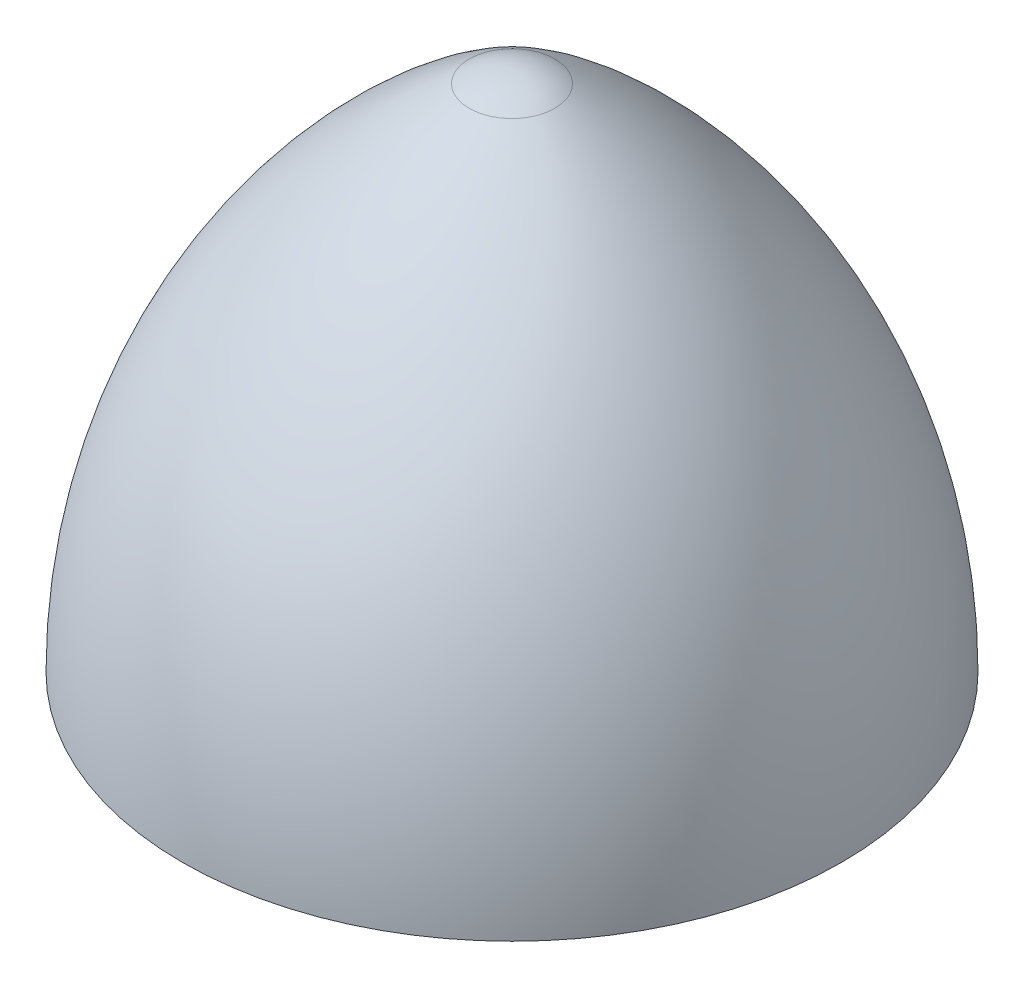
ISO-10303-21;
HEADER;
FILE_DESCRIPTION(('STEP AP214'),'2;1');
FILE_NAME('part.step','',(''),(''),'','','');
FILE_SCHEMA(('AUTOMOTIVE_DESIGN { 1 0 10303 214 1 1 1 1 }'));
ENDSEC;
DATA;
#1=APPLICATION_CONTEXT('core data for automotive mechanical design processes');
#2=APPLICATION_PROTOCOL_DEFINITION('international standard','automotive_design',2000,#1);
#3=PRODUCT_CONTEXT('',#1,'mechanical');
#4=PRODUCT('Part','Part','',(#3));
#5=PRODUCT_RELATED_PRODUCT_CATEGORY('part','',(#4));
#6=PRODUCT_DEFINITION_FORMATION('','',#4);
#7=PRODUCT_DEFINITION_CONTEXT('part definition',#1,'design');
#8=PRODUCT_DEFINITION('design','',#6,#7);
#9=PRODUCT_DEFINITION_SHAPE('','',#8);
#10=(LENGTH_UNIT() NAMED_UNIT(*) SI_UNIT(.MILLI.,.METRE.));
#11=(NAMED_UNIT(*) PLANE_ANGLE_UNIT() SI_UNIT($,.RADIAN.));
#12=(NAMED_UNIT(*) SI_UNIT($,.STERADIAN.) SOLID_ANGLE_UNIT());
#13=UNCERTAINTY_MEASURE_WITH_UNIT(LENGTH_MEASURE(1.E-05),#10,'distance_accuracy_value','');
#14=(GEOMETRIC_REPRESENTATION_CONTEXT(3) GLOBAL_UNCERTAINTY_ASSIGNED_CONTEXT((#13)) GLOBAL_UNIT_ASSIGNED_CONTEXT((#10,
#11,#12)) REPRESENTATION_CONTEXT('',''));
#15=CARTESIAN_POINT('',(0.,0.,0.));
#16=DIRECTION('',(0.,0.,1.));
#17=DIRECTION('',(1.,0.,0.));
#18=AXIS2_PLACEMENT_3D('',#15,#16,#17);
#19=CARTESIAN_POINT('',(0.,-25.4,0.));
#20=DIRECTION('',(0.,-1.,0.));
#21=DIRECTION('',(1.,0.,0.));
#22=AXIS2_PLACEMENT_3D('',#19,#20,#21);
#23=DEGENERATE_TOROIDAL_SURFACE('',#22,15.4340277777778,34.4840277777778,.F.);
#24=CARTESIAN_POINT('',(0.,4.07002967359048,0.));
#25=DIRECTION('',(0.,-1.,0.));
#26=DIRECTION('',(1.,0.,0.));
#27=AXIS2_PLACEMENT_3D('',#24,#25,#26);
#28=CIRCLE('',#27,2.47310830860532);
#29=CARTESIAN_POINT('',(2.47310830860533,4.07002967359048,0.));
#30=VERTEX_POINT('',#29);
#31=EDGE_CURVE('E11',#30,#30,#28,.T.);
#32=ORIENTED_EDGE('',*,*,#31,.T.);
#33=EDGE_LOOP('',(#32));
#34=FACE_BOUND('',#33,.T.);
#35=CARTESIAN_POINT('',(0.,-25.4,0.));
#36=DIRECTION('',(0.,-1.,0.));
#37=DIRECTION('',(1.,0.,0.));
#38=AXIS2_PLACEMENT_3D('',#35,#36,#37);
#39=CIRCLE('',#38,19.05);
#40=CARTESIAN_POINT('',(19.05,-25.4,0.));
#41=VERTEX_POINT('',#40);
#42=EDGE_CURVE('E55',#41,#41,#39,.T.);
#43=ORIENTED_EDGE('',*,*,#42,.F.);
#44=EDGE_LOOP('',(#43));
#45=FACE_BOUND('',#44,.T.);
#46=ADVANCED_FACE('F48',(#34,#45),#23,.F.);
#47=CARTESIAN_POINT('',(0.,0.,0.));
#48=DIRECTION('',(0.,-1.,0.));
#49=DIRECTION('',(1.,0.,0.));
#50=AXIS2_PLACEMENT_3D('',#47,#48,#49);
#51=SPHERICAL_SURFACE('',#50,4.76249999999997);
#52=ORIENTED_EDGE('',*,*,#31,.F.);
#53=EDGE_LOOP('',(#52));
#54=FACE_BOUND('',#53,.T.);
#55=ADVANCED_FACE('F81',(#54),#51,.T.);
#56=CARTESIAN_POINT('',(0.,-25.4,0.));
#57=DIRECTION('',(0.,-1.,0.));
#58=DIRECTION('',(1.,0.,0.));
#59=AXIS2_PLACEMENT_3D('',#56,#57,#58);
#60=PLANE('',#59);
#61=CARTESIAN_POINT('',(0.,-25.4,0.));
#62=DIRECTION('',(0.,-1.,0.));
#63=DIRECTION('',(0.,0.,-1.));
#64=AXIS2_PLACEMENT_3D('',#61,#62,#63);
#65=CIRCLE('',#64,5.75436999999999);
#66=CARTESIAN_POINT('',(0.,-25.4,-5.75436999999999));
#67=VERTEX_POINT('',#66);
#68=EDGE_CURVE('E69',#67,#67,#65,.T.);
#69=ORIENTED_EDGE('',*,*,#68,.F.);
#70=EDGE_LOOP('',(#69));
#71=FACE_BOUND('',#70,.T.);
#72=ORIENTED_EDGE('',*,*,#42,.T.);
#73=EDGE_LOOP('',(#72));
#74=FACE_BOUND('',#73,.T.);
#75=ADVANCED_FACE('F62',(#71,#74),#60,.T.);
#76=CARTESIAN_POINT('',(0.,-8.89,0.));
#77=DIRECTION('',(0.,-1.,0.));
#78=DIRECTION('',(0.,0.,-1.));
#79=AXIS2_PLACEMENT_3D('',#76,#77,#78);
#80=CONICAL_SURFACE('',#79,5.75437,1.02974425867665);
#81=CARTESIAN_POINT('',(0.,-5.43242567968638,0.));
#82=VERTEX_POINT('',#81);
#83=VERTEX_LOOP('',#82);
#84=FACE_BOUND('',#83,.T.);
#85=CARTESIAN_POINT('',(0.,-8.89,0.));
#86=DIRECTION('',(0.,-1.,0.));
#87=DIRECTION('',(0.,0.,-1.));
#88=AXIS2_PLACEMENT_3D('',#85,#86,#87);
#89=CIRCLE('',#88,5.75437);
#90=CARTESIAN_POINT('',(0.,-8.89,-5.75437));
#91=VERTEX_POINT('',#90);
#92=EDGE_CURVE('E66',#91,#91,#89,.T.);
#93=ORIENTED_EDGE('',*,*,#92,.T.);
#94=EDGE_LOOP('',(#93));
#95=FACE_BOUND('',#94,.T.);
#96=ADVANCED_FACE('F58',(#84,#95),#80,.F.);
#97=CARTESIAN_POINT('',(0.,-25.4,0.));
#98=DIRECTION('',(0.,-1.,0.));
#99=DIRECTION('',(0.,0.,-1.));
#100=AXIS2_PLACEMENT_3D('',#97,#98,#99);
#101=CYLINDRICAL_SURFACE('',#100,5.75436999999999);
#102=ORIENTED_EDGE('',*,*,#92,.F.);
#103=EDGE_LOOP('',(#102));
#104=FACE_BOUND('',#103,.T.);
#105=ORIENTED_EDGE('',*,*,#68,.T.);
#106=EDGE_LOOP('',(#105));
#107=FACE_BOUND('',#106,.T.);
#108=ADVANCED_FACE('F61',(#104,#107),#101,.F.);
#109=CLOSED_SHELL('',(#46,#55,#75,#96,#108));
#110=MANIFOLD_SOLID_BREP('B2',#109);
#111=ADVANCED_BREP_SHAPE_REPRESENTATION('',(#18,#110),#14);
#112=SHAPE_DEFINITION_REPRESENTATION(#9,#111);
ENDSEC;
END-ISO-10303-21;
